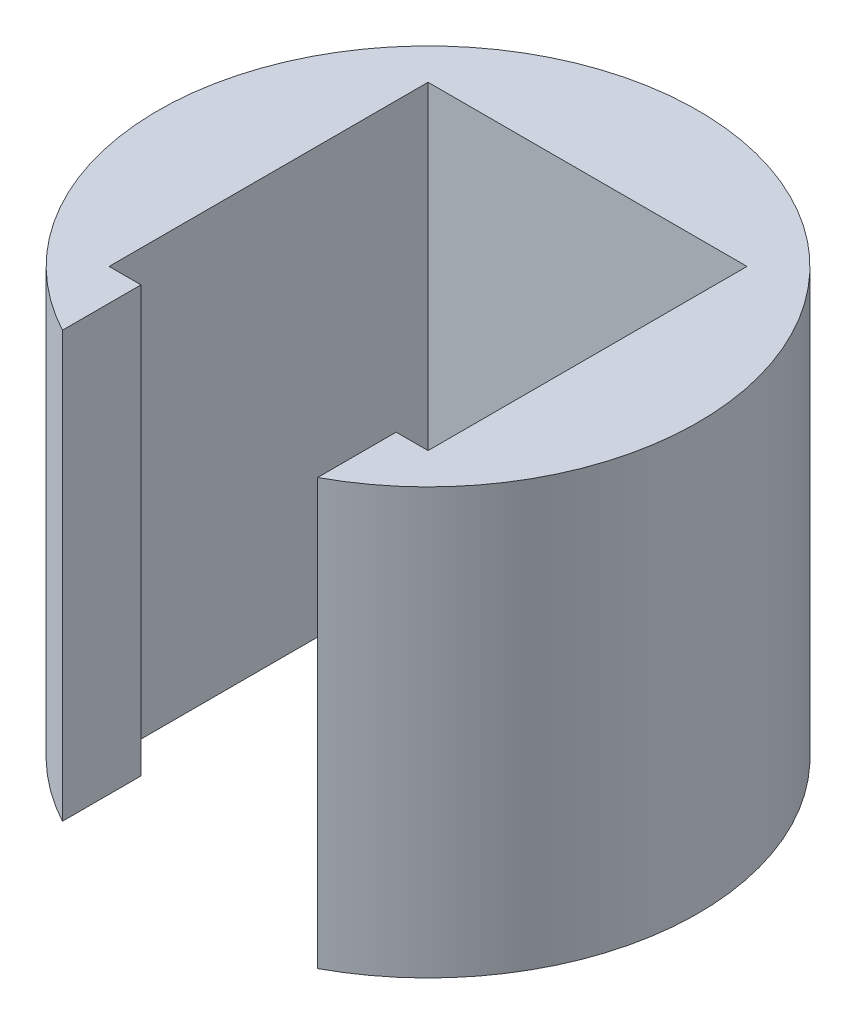
ISO-10303-21;
HEADER;
FILE_DESCRIPTION(('STEP AP214'),'2;1');
FILE_NAME('part.step','',(''),(''),'','','');
FILE_SCHEMA(('AUTOMOTIVE_DESIGN { 1 0 10303 214 1 1 1 1 }'));
ENDSEC;
DATA;
#1=APPLICATION_CONTEXT('core data for automotive mechanical design processes');
#2=APPLICATION_PROTOCOL_DEFINITION('international standard','automotive_design',2000,#1);
#3=PRODUCT_CONTEXT('',#1,'mechanical');
#4=PRODUCT('Part','Part','',(#3));
#5=PRODUCT_RELATED_PRODUCT_CATEGORY('part','',(#4));
#6=PRODUCT_DEFINITION_FORMATION('','',#4);
#7=PRODUCT_DEFINITION_CONTEXT('part definition',#1,'design');
#8=PRODUCT_DEFINITION('design','',#6,#7);
#9=PRODUCT_DEFINITION_SHAPE('','',#8);
#10=(LENGTH_UNIT() NAMED_UNIT(*) SI_UNIT(.MILLI.,.METRE.));
#11=(NAMED_UNIT(*) PLANE_ANGLE_UNIT() SI_UNIT($,.RADIAN.));
#12=(NAMED_UNIT(*) SI_UNIT($,.STERADIAN.) SOLID_ANGLE_UNIT());
#13=UNCERTAINTY_MEASURE_WITH_UNIT(LENGTH_MEASURE(1.E-05),#10,'distance_accuracy_value','');
#14=(GEOMETRIC_REPRESENTATION_CONTEXT(3) GLOBAL_UNCERTAINTY_ASSIGNED_CONTEXT((#13)) GLOBAL_UNIT_ASSIGNED_CONTEXT((#10,
#11,#12)) REPRESENTATION_CONTEXT('',''));
#15=CARTESIAN_POINT('',(0.,0.,0.));
#16=DIRECTION('',(0.,0.,1.));
#17=DIRECTION('',(1.,0.,0.));
#18=AXIS2_PLACEMENT_3D('',#15,#16,#17);
#19=CARTESIAN_POINT('',(7.5,20.,-7.5));
#20=DIRECTION('',(1.,0.,0.));
#21=DIRECTION('',(0.,0.,-1.));
#22=AXIS2_PLACEMENT_3D('',#19,#20,#21);
#23=PLANE('',#22);
#24=DIRECTION('',(0.,0.,1.));
#25=VECTOR('',#24,1.);
#26=CARTESIAN_POINT('',(7.5,0.,-7.5));
#27=LINE('',#26,#25);
#28=CARTESIAN_POINT('',(7.5,0.,-7.5));
#29=VERTEX_POINT('',#28);
#30=CARTESIAN_POINT('',(7.5,0.,7.5));
#31=VERTEX_POINT('',#30);
#32=EDGE_CURVE('E140',#29,#31,#27,.T.);
#33=ORIENTED_EDGE('',*,*,#32,.T.);
#34=DIRECTION('',(0.,-1.,0.));
#35=VECTOR('',#34,1.);
#36=CARTESIAN_POINT('',(7.5,20.,7.5));
#37=LINE('',#36,#35);
#38=CARTESIAN_POINT('',(7.5,20.,7.5));
#39=VERTEX_POINT('',#38);
#40=EDGE_CURVE('E11',#39,#31,#37,.T.);
#41=ORIENTED_EDGE('',*,*,#40,.F.);
#42=DIRECTION('',(0.,0.,1.));
#43=VECTOR('',#42,1.);
#44=CARTESIAN_POINT('',(7.5,20.,-7.5));
#45=LINE('',#44,#43);
#46=CARTESIAN_POINT('',(7.5,20.,-7.5));
#47=VERTEX_POINT('',#46);
#48=EDGE_CURVE('E162',#47,#39,#45,.T.);
#49=ORIENTED_EDGE('',*,*,#48,.F.);
#50=DIRECTION('',(0.,-1.,0.));
#51=VECTOR('',#50,1.);
#52=CARTESIAN_POINT('',(7.5,20.,-7.5));
#53=LINE('',#52,#51);
#54=EDGE_CURVE('E136',#47,#29,#53,.T.);
#55=ORIENTED_EDGE('',*,*,#54,.T.);
#56=EDGE_LOOP('',(#33,#41,#49,#55));
#57=FACE_BOUND('',#56,.T.);
#58=ADVANCED_FACE('F39',(#57),#23,.F.);
#59=CARTESIAN_POINT('',(5.99964317105099,20.,7.5));
#60=DIRECTION('',(0.,0.,1.));
#61=DIRECTION('',(1.,0.,0.));
#62=AXIS2_PLACEMENT_3D('',#59,#60,#61);
#63=PLANE('',#62);
#64=DIRECTION('',(-1.,0.,0.));
#65=VECTOR('',#64,1.);
#66=CARTESIAN_POINT('',(5.99964317105099,0.,7.5));
#67=LINE('',#66,#65);
#68=CARTESIAN_POINT('',(5.99964317105099,0.,7.5));
#69=VERTEX_POINT('',#68);
#70=EDGE_CURVE('E144',#31,#69,#67,.T.);
#71=ORIENTED_EDGE('',*,*,#70,.T.);
#72=DIRECTION('',(0.,-1.,0.));
#73=VECTOR('',#72,1.);
#74=CARTESIAN_POINT('',(5.99964317105099,20.,7.5));
#75=LINE('',#74,#73);
#76=CARTESIAN_POINT('',(5.99964317105099,20.,7.5));
#77=VERTEX_POINT('',#76);
#78=EDGE_CURVE('E48',#77,#69,#75,.T.);
#79=ORIENTED_EDGE('',*,*,#78,.F.);
#80=DIRECTION('',(-1.,0.,0.));
#81=VECTOR('',#80,1.);
#82=CARTESIAN_POINT('',(5.99964317105099,20.,7.5));
#83=LINE('',#82,#81);
#84=EDGE_CURVE('E99',#39,#77,#83,.T.);
#85=ORIENTED_EDGE('',*,*,#84,.F.);
#86=ORIENTED_EDGE('',*,*,#40,.T.);
#87=EDGE_LOOP('',(#71,#79,#85,#86));
#88=FACE_BOUND('',#87,.T.);
#89=ADVANCED_FACE('F208',(#88),#63,.F.);
#90=CARTESIAN_POINT('',(5.99964317105099,20.,11.1934928337879));
#91=DIRECTION('',(1.,0.,0.));
#92=DIRECTION('',(0.,0.,-1.));
#93=AXIS2_PLACEMENT_3D('',#90,#91,#92);
#94=PLANE('',#93);
#95=DIRECTION('',(0.,0.,1.));
#96=VECTOR('',#95,1.);
#97=CARTESIAN_POINT('',(5.99964317105099,0.,11.1934928337879));
#98=LINE('',#97,#96);
#99=CARTESIAN_POINT('',(5.99964317105099,0.,11.1934928337879));
#100=VERTEX_POINT('',#99);
#101=EDGE_CURVE('E147',#69,#100,#98,.T.);
#102=ORIENTED_EDGE('',*,*,#101,.T.);
#103=DIRECTION('',(0.,-1.,0.));
#104=VECTOR('',#103,1.);
#105=CARTESIAN_POINT('',(5.99964317105099,20.,11.1934928337879));
#106=LINE('',#105,#104);
#107=CARTESIAN_POINT('',(5.99964317105099,20.,11.1934928337879));
#108=VERTEX_POINT('',#107);
#109=EDGE_CURVE('E173',#108,#100,#106,.T.);
#110=ORIENTED_EDGE('',*,*,#109,.F.);
#111=DIRECTION('',(0.,0.,1.));
#112=VECTOR('',#111,1.);
#113=CARTESIAN_POINT('',(5.99964317105099,20.,11.1934928337879));
#114=LINE('',#113,#112);
#115=EDGE_CURVE('E183',#77,#108,#114,.T.);
#116=ORIENTED_EDGE('',*,*,#115,.F.);
#117=ORIENTED_EDGE('',*,*,#78,.T.);
#118=EDGE_LOOP('',(#102,#110,#116,#117));
#119=FACE_BOUND('',#118,.T.);
#120=ADVANCED_FACE('F181',(#119),#94,.F.);
#121=CARTESIAN_POINT('',(0.,20.,0.));
#122=DIRECTION('',(0.,-1.,0.));
#123=DIRECTION('',(0.,0.,-1.));
#124=AXIS2_PLACEMENT_3D('',#121,#122,#123);
#125=CYLINDRICAL_SURFACE('',#124,12.7);
#126=CARTESIAN_POINT('',(0.,0.,0.));
#127=DIRECTION('',(0.,1.,0.));
#128=DIRECTION('',(0.,0.,1.));
#129=AXIS2_PLACEMENT_3D('',#126,#127,#128);
#130=CIRCLE('',#129,12.7);
#131=CARTESIAN_POINT('',(-5.99964317105099,0.,11.1934928337879));
#132=VERTEX_POINT('',#131);
#133=EDGE_CURVE('E150',#100,#132,#130,.T.);
#134=ORIENTED_EDGE('',*,*,#133,.T.);
#135=DIRECTION('',(0.,-1.,0.));
#136=VECTOR('',#135,1.);
#137=CARTESIAN_POINT('',(-5.99964317105099,20.,11.1934928337879));
#138=LINE('',#137,#136);
#139=CARTESIAN_POINT('',(-5.99964317105099,20.,11.1934928337879));
#140=VERTEX_POINT('',#139);
#141=EDGE_CURVE('E169',#140,#132,#138,.T.);
#142=ORIENTED_EDGE('',*,*,#141,.F.);
#143=CARTESIAN_POINT('',(0.,20.,0.));
#144=DIRECTION('',(0.,1.,0.));
#145=DIRECTION('',(0.,0.,1.));
#146=AXIS2_PLACEMENT_3D('',#143,#144,#145);
#147=CIRCLE('',#146,12.7);
#148=EDGE_CURVE('E196',#108,#140,#147,.T.);
#149=ORIENTED_EDGE('',*,*,#148,.F.);
#150=ORIENTED_EDGE('',*,*,#109,.T.);
#151=EDGE_LOOP('',(#134,#142,#149,#150));
#152=FACE_BOUND('',#151,.T.);
#153=ADVANCED_FACE('F191',(#152),#125,.T.);
#154=CARTESIAN_POINT('',(-5.99964317105099,20.,7.5));
#155=DIRECTION('',(-1.,0.,0.));
#156=DIRECTION('',(0.,0.,1.));
#157=AXIS2_PLACEMENT_3D('',#154,#155,#156);
#158=PLANE('',#157);
#159=DIRECTION('',(0.,0.,-1.));
#160=VECTOR('',#159,1.);
#161=CARTESIAN_POINT('',(-5.99964317105099,0.,7.5));
#162=LINE('',#161,#160);
#163=CARTESIAN_POINT('',(-5.99964317105099,0.,7.5));
#164=VERTEX_POINT('',#163);
#165=EDGE_CURVE('E153',#132,#164,#162,.T.);
#166=ORIENTED_EDGE('',*,*,#165,.T.);
#167=DIRECTION('',(0.,-1.,0.));
#168=VECTOR('',#167,1.);
#169=CARTESIAN_POINT('',(-5.99964317105099,20.,7.5));
#170=LINE('',#169,#168);
#171=CARTESIAN_POINT('',(-5.99964317105099,20.,7.5));
#172=VERTEX_POINT('',#171);
#173=EDGE_CURVE('E129',#172,#164,#170,.T.);
#174=ORIENTED_EDGE('',*,*,#173,.F.);
#175=DIRECTION('',(0.,0.,-1.));
#176=VECTOR('',#175,1.);
#177=CARTESIAN_POINT('',(-5.99964317105099,20.,7.5));
#178=LINE('',#177,#176);
#179=EDGE_CURVE('E118',#140,#172,#178,.T.);
#180=ORIENTED_EDGE('',*,*,#179,.F.);
#181=ORIENTED_EDGE('',*,*,#141,.T.);
#182=EDGE_LOOP('',(#166,#174,#180,#181));
#183=FACE_BOUND('',#182,.T.);
#184=ADVANCED_FACE('F194',(#183),#158,.F.);
#185=CARTESIAN_POINT('',(-7.5,20.,7.5));
#186=DIRECTION('',(0.,0.,1.));
#187=DIRECTION('',(1.,0.,0.));
#188=AXIS2_PLACEMENT_3D('',#185,#186,#187);
#189=PLANE('',#188);
#190=DIRECTION('',(-1.,0.,0.));
#191=VECTOR('',#190,1.);
#192=CARTESIAN_POINT('',(-7.5,0.,7.5));
#193=LINE('',#192,#191);
#194=CARTESIAN_POINT('',(-7.5,0.,7.5));
#195=VERTEX_POINT('',#194);
#196=EDGE_CURVE('E127',#164,#195,#193,.T.);
#197=ORIENTED_EDGE('',*,*,#196,.T.);
#198=DIRECTION('',(0.,-1.,0.));
#199=VECTOR('',#198,1.);
#200=CARTESIAN_POINT('',(-7.5,20.,7.5));
#201=LINE('',#200,#199);
#202=CARTESIAN_POINT('',(-7.5,20.,7.5));
#203=VERTEX_POINT('',#202);
#204=EDGE_CURVE('E124',#203,#195,#201,.T.);
#205=ORIENTED_EDGE('',*,*,#204,.F.);
#206=DIRECTION('',(-1.,0.,0.));
#207=VECTOR('',#206,1.);
#208=CARTESIAN_POINT('',(-7.5,20.,7.5));
#209=LINE('',#208,#207);
#210=EDGE_CURVE('E112',#172,#203,#209,.T.);
#211=ORIENTED_EDGE('',*,*,#210,.F.);
#212=ORIENTED_EDGE('',*,*,#173,.T.);
#213=EDGE_LOOP('',(#197,#205,#211,#212));
#214=FACE_BOUND('',#213,.T.);
#215=ADVANCED_FACE('F125',(#214),#189,.F.);
#216=CARTESIAN_POINT('',(-7.5,20.,-7.5));
#217=DIRECTION('',(-1.,0.,0.));
#218=DIRECTION('',(0.,0.,1.));
#219=AXIS2_PLACEMENT_3D('',#216,#217,#218);
#220=PLANE('',#219);
#221=DIRECTION('',(0.,0.,-1.));
#222=VECTOR('',#221,1.);
#223=CARTESIAN_POINT('',(-7.5,0.,-7.5));
#224=LINE('',#223,#222);
#225=CARTESIAN_POINT('',(-7.5,0.,-7.5));
#226=VERTEX_POINT('',#225);
#227=EDGE_CURVE('E85',#195,#226,#224,.T.);
#228=ORIENTED_EDGE('',*,*,#227,.T.);
#229=DIRECTION('',(0.,-1.,0.));
#230=VECTOR('',#229,1.);
#231=CARTESIAN_POINT('',(-7.5,20.,-7.5));
#232=LINE('',#231,#230);
#233=CARTESIAN_POINT('',(-7.5,20.,-7.5));
#234=VERTEX_POINT('',#233);
#235=EDGE_CURVE('E130',#234,#226,#232,.T.);
#236=ORIENTED_EDGE('',*,*,#235,.F.);
#237=DIRECTION('',(0.,0.,-1.));
#238=VECTOR('',#237,1.);
#239=CARTESIAN_POINT('',(-7.5,20.,-7.5));
#240=LINE('',#239,#238);
#241=EDGE_CURVE('E116',#203,#234,#240,.T.);
#242=ORIENTED_EDGE('',*,*,#241,.F.);
#243=ORIENTED_EDGE('',*,*,#204,.T.);
#244=EDGE_LOOP('',(#228,#236,#242,#243));
#245=FACE_BOUND('',#244,.T.);
#246=ADVANCED_FACE('F132',(#245),#220,.F.);
#247=CARTESIAN_POINT('',(-7.5,20.,-7.5));
#248=DIRECTION('',(0.,0.,-1.));
#249=DIRECTION('',(-1.,0.,0.));
#250=AXIS2_PLACEMENT_3D('',#247,#248,#249);
#251=PLANE('',#250);
#252=DIRECTION('',(1.,0.,0.));
#253=VECTOR('',#252,1.);
#254=CARTESIAN_POINT('',(-7.5,0.,-7.5));
#255=LINE('',#254,#253);
#256=EDGE_CURVE('E91',#226,#29,#255,.T.);
#257=ORIENTED_EDGE('',*,*,#256,.T.);
#258=ORIENTED_EDGE('',*,*,#54,.F.);
#259=DIRECTION('',(1.,0.,0.));
#260=VECTOR('',#259,1.);
#261=CARTESIAN_POINT('',(-7.5,20.,-7.5));
#262=LINE('',#261,#260);
#263=EDGE_CURVE('E56',#234,#47,#262,.T.);
#264=ORIENTED_EDGE('',*,*,#263,.F.);
#265=ORIENTED_EDGE('',*,*,#235,.T.);
#266=EDGE_LOOP('',(#257,#258,#264,#265));
#267=FACE_BOUND('',#266,.T.);
#268=ADVANCED_FACE('F224',(#267),#251,.F.);
#269=CARTESIAN_POINT('',(0.,20.,0.));
#270=DIRECTION('',(0.,1.,0.));
#271=DIRECTION('',(0.,0.,1.));
#272=AXIS2_PLACEMENT_3D('',#269,#270,#271);
#273=PLANE('',#272);
#274=ORIENTED_EDGE('',*,*,#48,.T.);
#275=ORIENTED_EDGE('',*,*,#84,.T.);
#276=ORIENTED_EDGE('',*,*,#115,.T.);
#277=ORIENTED_EDGE('',*,*,#148,.T.);
#278=ORIENTED_EDGE('',*,*,#179,.T.);
#279=ORIENTED_EDGE('',*,*,#210,.T.);
#280=ORIENTED_EDGE('',*,*,#241,.T.);
#281=ORIENTED_EDGE('',*,*,#263,.T.);
#282=EDGE_LOOP('',(#274,#275,#276,#277,#278,#279,#280,#281));
#283=FACE_BOUND('',#282,.T.);
#284=ADVANCED_FACE('F114',(#283),#273,.T.);
#285=CARTESIAN_POINT('',(0.,0.,0.));
#286=DIRECTION('',(0.,1.,0.));
#287=DIRECTION('',(0.,0.,1.));
#288=AXIS2_PLACEMENT_3D('',#285,#286,#287);
#289=PLANE('',#288);
#290=ORIENTED_EDGE('',*,*,#32,.F.);
#291=ORIENTED_EDGE('',*,*,#256,.F.);
#292=ORIENTED_EDGE('',*,*,#227,.F.);
#293=ORIENTED_EDGE('',*,*,#196,.F.);
#294=ORIENTED_EDGE('',*,*,#165,.F.);
#295=ORIENTED_EDGE('',*,*,#133,.F.);
#296=ORIENTED_EDGE('',*,*,#101,.F.);
#297=ORIENTED_EDGE('',*,*,#70,.F.);
#298=EDGE_LOOP('',(#290,#291,#292,#293,#294,#295,#296,#297));
#299=FACE_BOUND('',#298,.T.);
#300=ADVANCED_FACE('F187',(#299),#289,.F.);
#301=CLOSED_SHELL('',(#58,#89,#120,#153,#184,#215,#246,#268,#284,#300));
#302=MANIFOLD_SOLID_BREP('B2',#301);
#303=ADVANCED_BREP_SHAPE_REPRESENTATION('',(#18,#302),#14);
#304=SHAPE_DEFINITION_REPRESENTATION(#9,#303);
ENDSEC;
END-ISO-10303-21;
